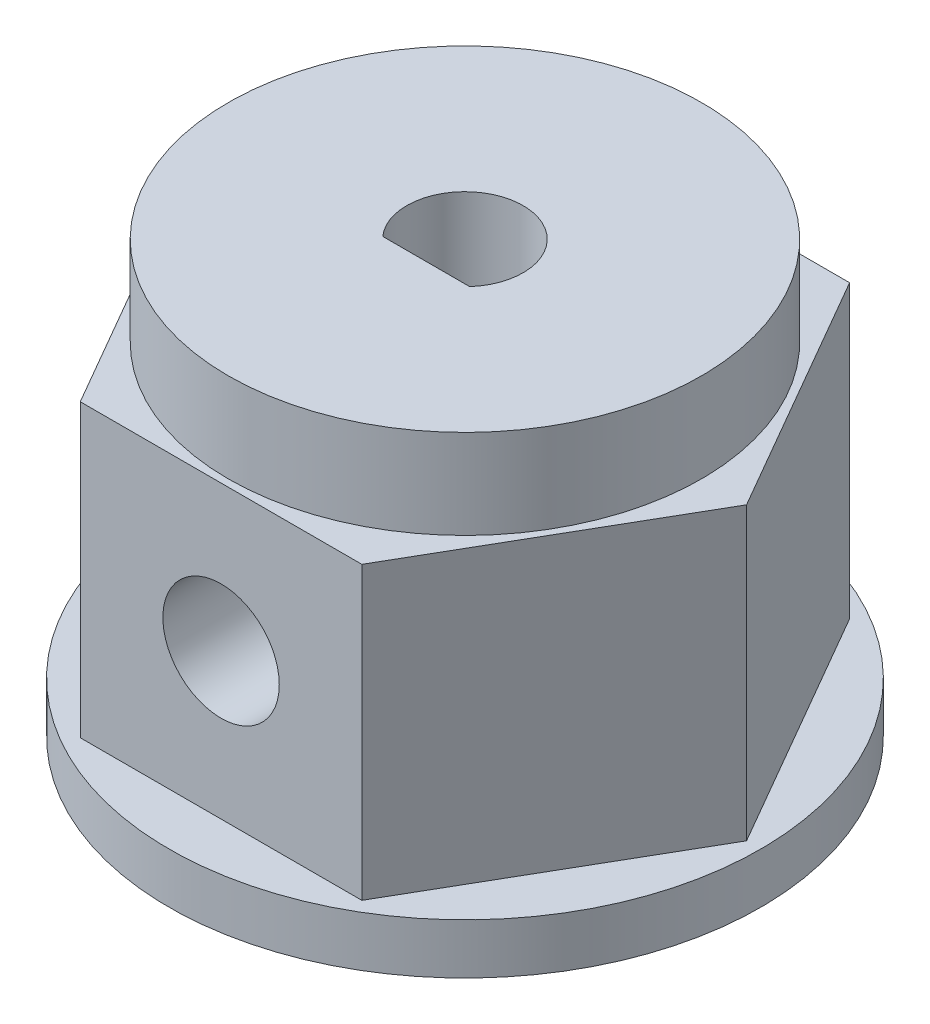
ISO-10303-21;
HEADER;
FILE_DESCRIPTION(('STEP AP214'),'2;1');
FILE_NAME('part.step','',(''),(''),'','','');
FILE_SCHEMA(('AUTOMOTIVE_DESIGN { 1 0 10303 214 1 1 1 1 }'));
ENDSEC;
DATA;
#1=APPLICATION_CONTEXT('core data for automotive mechanical design processes');
#2=APPLICATION_PROTOCOL_DEFINITION('international standard','automotive_design',2000,#1);
#3=PRODUCT_CONTEXT('',#1,'mechanical');
#4=PRODUCT('Part','Part','',(#3));
#5=PRODUCT_RELATED_PRODUCT_CATEGORY('part','',(#4));
#6=PRODUCT_DEFINITION_FORMATION('','',#4);
#7=PRODUCT_DEFINITION_CONTEXT('part definition',#1,'design');
#8=PRODUCT_DEFINITION('design','',#6,#7);
#9=PRODUCT_DEFINITION_SHAPE('','',#8);
#10=(LENGTH_UNIT() NAMED_UNIT(*) SI_UNIT(.MILLI.,.METRE.));
#11=(NAMED_UNIT(*) PLANE_ANGLE_UNIT() SI_UNIT($,.RADIAN.));
#12=(NAMED_UNIT(*) SI_UNIT($,.STERADIAN.) SOLID_ANGLE_UNIT());
#13=UNCERTAINTY_MEASURE_WITH_UNIT(LENGTH_MEASURE(1.E-05),#10,'distance_accuracy_value','');
#14=(GEOMETRIC_REPRESENTATION_CONTEXT(3) GLOBAL_UNCERTAINTY_ASSIGNED_CONTEXT((#13)) GLOBAL_UNIT_ASSIGNED_CONTEXT((#10,
#11,#12)) REPRESENTATION_CONTEXT('',''));
#15=CARTESIAN_POINT('',(0.,0.,0.));
#16=DIRECTION('',(0.,0.,1.));
#17=DIRECTION('',(1.,0.,0.));
#18=AXIS2_PLACEMENT_3D('',#15,#16,#17);
#19=CARTESIAN_POINT('',(-1.12,-1.3,0.997797574661314));
#20=DIRECTION('',(0.,0.,1.));
#21=DIRECTION('',(1.,0.,0.));
#22=AXIS2_PLACEMENT_3D('',#19,#20,#21);
#23=PLANE('',#22);
#24=DIRECTION('',(0.,1.,0.));
#25=VECTOR('',#24,1.);
#26=CARTESIAN_POINT('',(1.12,-1.3,0.997797574661314));
#27=LINE('',#26,#25);
#28=CARTESIAN_POINT('',(1.12,4.74779757466134,0.997797574661313));
#29=VERTEX_POINT('',#28);
#30=CARTESIAN_POINT('',(1.12,9.8,0.997797574661314));
#31=VERTEX_POINT('',#30);
#32=EDGE_CURVE('E138',#29,#31,#27,.T.);
#33=ORIENTED_EDGE('',*,*,#32,.F.);
#34=CARTESIAN_POINT('',(0.,3.75,0.997797574661313));
#35=DIRECTION('',(0.,0.,1.));
#36=DIRECTION('',(1.,0.,0.));
#37=AXIS2_PLACEMENT_3D('',#34,#35,#36);
#38=CIRCLE('',#37,1.5);
#39=CARTESIAN_POINT('',(-1.12,4.74779757466129,0.997797574661313));
#40=VERTEX_POINT('',#39);
#41=EDGE_CURVE('E126',#40,#29,#38,.F.);
#42=ORIENTED_EDGE('',*,*,#41,.F.);
#43=DIRECTION('',(0.,1.,0.));
#44=VECTOR('',#43,1.);
#45=CARTESIAN_POINT('',(-1.12,-1.3,0.997797574661314));
#46=LINE('',#45,#44);
#47=CARTESIAN_POINT('',(-1.12,9.8,0.997797574661314));
#48=VERTEX_POINT('',#47);
#49=EDGE_CURVE('E58',#40,#48,#46,.T.);
#50=ORIENTED_EDGE('',*,*,#49,.T.);
#51=DIRECTION('',(1.,0.,0.));
#52=VECTOR('',#51,1.);
#53=CARTESIAN_POINT('',(-1.12,9.8,0.997797574661314));
#54=LINE('',#53,#52);
#55=EDGE_CURVE('E276',#48,#31,#54,.T.);
#56=ORIENTED_EDGE('',*,*,#55,.T.);
#57=EDGE_LOOP('',(#33,#42,#50,#56));
#58=FACE_BOUND('',#57,.T.);
#59=ADVANCED_FACE('F34',(#58),#23,.F.);
#60=CARTESIAN_POINT('',(3.62864644185677,7.5,6.28499999999993));
#61=DIRECTION('',(-0.866025403784439,0.,-0.5));
#62=DIRECTION('',(-0.5,0.,0.866025403784439));
#63=AXIS2_PLACEMENT_3D('',#60,#61,#62);
#64=PLANE('',#63);
#65=DIRECTION('',(0.5,0.,-0.866025403784439));
#66=VECTOR('',#65,1.);
#67=CARTESIAN_POINT('',(3.62864644185677,0.,6.28499999999993));
#68=LINE('',#67,#66);
#69=CARTESIAN_POINT('',(3.62864644185677,0.,6.28499999999993));
#70=VERTEX_POINT('',#69);
#71=CARTESIAN_POINT('',(7.25729288371349,0.,0.));
#72=VERTEX_POINT('',#71);
#73=EDGE_CURVE('E152',#70,#72,#68,.T.);
#74=ORIENTED_EDGE('',*,*,#73,.T.);
#75=DIRECTION('',(0.,-1.,0.));
#76=VECTOR('',#75,1.);
#77=CARTESIAN_POINT('',(7.25729288371349,7.5,0.));
#78=LINE('',#77,#76);
#79=CARTESIAN_POINT('',(7.25729288371349,7.5,0.));
#80=VERTEX_POINT('',#79);
#81=EDGE_CURVE('E38',#80,#72,#78,.T.);
#82=ORIENTED_EDGE('',*,*,#81,.F.);
#83=DIRECTION('',(0.5,0.,-0.866025403784439));
#84=VECTOR('',#83,1.);
#85=CARTESIAN_POINT('',(3.62864644185677,7.5,6.28499999999993));
#86=LINE('',#85,#84);
#87=CARTESIAN_POINT('',(3.62864644185677,7.5,6.28499999999993));
#88=VERTEX_POINT('',#87);
#89=EDGE_CURVE('E154',#88,#80,#86,.T.);
#90=ORIENTED_EDGE('',*,*,#89,.F.);
#91=DIRECTION('',(0.,-1.,0.));
#92=VECTOR('',#91,1.);
#93=CARTESIAN_POINT('',(3.62864644185677,7.5,6.28499999999993));
#94=LINE('',#93,#92);
#95=EDGE_CURVE('E168',#88,#70,#94,.T.);
#96=ORIENTED_EDGE('',*,*,#95,.T.);
#97=EDGE_LOOP('',(#74,#82,#90,#96));
#98=FACE_BOUND('',#97,.T.);
#99=ADVANCED_FACE('F36',(#98),#64,.F.);
#100=CARTESIAN_POINT('',(7.25729288371349,7.5,0.));
#101=DIRECTION('',(-0.866025403784439,0.,0.5));
#102=DIRECTION('',(0.5,0.,0.866025403784439));
#103=AXIS2_PLACEMENT_3D('',#100,#101,#102);
#104=PLANE('',#103);
#105=DIRECTION('',(-0.5,0.,-0.866025403784439));
#106=VECTOR('',#105,1.);
#107=CARTESIAN_POINT('',(7.25729288371349,0.,0.));
#108=LINE('',#107,#106);
#109=CARTESIAN_POINT('',(3.62864644185665,0.,-6.28500000000001));
#110=VERTEX_POINT('',#109);
#111=EDGE_CURVE('E171',#72,#110,#108,.T.);
#112=ORIENTED_EDGE('',*,*,#111,.T.);
#113=DIRECTION('',(0.,-1.,0.));
#114=VECTOR('',#113,1.);
#115=CARTESIAN_POINT('',(3.62864644185665,7.5,-6.28500000000001));
#116=LINE('',#115,#114);
#117=CARTESIAN_POINT('',(3.62864644185665,7.5,-6.28500000000001));
#118=VERTEX_POINT('',#117);
#119=EDGE_CURVE('E195',#118,#110,#116,.T.);
#120=ORIENTED_EDGE('',*,*,#119,.F.);
#121=DIRECTION('',(-0.5,0.,-0.866025403784439));
#122=VECTOR('',#121,1.);
#123=CARTESIAN_POINT('',(7.25729288371349,7.5,0.));
#124=LINE('',#123,#122);
#125=EDGE_CURVE('E157',#80,#118,#124,.T.);
#126=ORIENTED_EDGE('',*,*,#125,.F.);
#127=ORIENTED_EDGE('',*,*,#81,.T.);
#128=EDGE_LOOP('',(#112,#120,#126,#127));
#129=FACE_BOUND('',#128,.T.);
#130=ADVANCED_FACE('F203',(#129),#104,.F.);
#131=CARTESIAN_POINT('',(3.62864644185665,7.5,-6.28500000000001));
#132=DIRECTION('',(0.,0.,1.));
#133=DIRECTION('',(1.,0.,0.));
#134=AXIS2_PLACEMENT_3D('',#131,#132,#133);
#135=PLANE('',#134);
#136=DIRECTION('',(-1.,0.,0.));
#137=VECTOR('',#136,1.);
#138=CARTESIAN_POINT('',(3.62864644185665,0.,-6.28500000000001));
#139=LINE('',#138,#137);
#140=CARTESIAN_POINT('',(-3.62864644185681,0.,-6.28500000000001));
#141=VERTEX_POINT('',#140);
#142=EDGE_CURVE('E174',#110,#141,#139,.T.);
#143=ORIENTED_EDGE('',*,*,#142,.T.);
#144=DIRECTION('',(0.,-1.,0.));
#145=VECTOR('',#144,1.);
#146=CARTESIAN_POINT('',(-3.62864644185681,7.5,-6.28500000000001));
#147=LINE('',#146,#145);
#148=CARTESIAN_POINT('',(-3.62864644185681,7.5,-6.28500000000001));
#149=VERTEX_POINT('',#148);
#150=EDGE_CURVE('E193',#149,#141,#147,.T.);
#151=ORIENTED_EDGE('',*,*,#150,.F.);
#152=DIRECTION('',(-1.,0.,0.));
#153=VECTOR('',#152,1.);
#154=CARTESIAN_POINT('',(3.62864644185665,7.5,-6.28500000000001));
#155=LINE('',#154,#153);
#156=EDGE_CURVE('E160',#118,#149,#155,.T.);
#157=ORIENTED_EDGE('',*,*,#156,.F.);
#158=ORIENTED_EDGE('',*,*,#119,.T.);
#159=EDGE_LOOP('',(#143,#151,#157,#158));
#160=FACE_BOUND('',#159,.T.);
#161=ADVANCED_FACE('F222',(#160),#135,.F.);
#162=CARTESIAN_POINT('',(-3.62864644185681,7.5,-6.28500000000001));
#163=DIRECTION('',(0.866025403784438,0.,0.500000000000001));
#164=DIRECTION('',(0.500000000000001,0.,-0.866025403784438));
#165=AXIS2_PLACEMENT_3D('',#162,#163,#164);
#166=PLANE('',#165);
#167=DIRECTION('',(-0.500000000000001,0.,0.866025403784438));
#168=VECTOR('',#167,1.);
#169=CARTESIAN_POINT('',(-3.62864644185681,0.,-6.28500000000001));
#170=LINE('',#169,#168);
#171=CARTESIAN_POINT('',(-7.25729288371363,0.,0.));
#172=VERTEX_POINT('',#171);
#173=EDGE_CURVE('E177',#141,#172,#170,.T.);
#174=ORIENTED_EDGE('',*,*,#173,.T.);
#175=DIRECTION('',(0.,-1.,0.));
#176=VECTOR('',#175,1.);
#177=CARTESIAN_POINT('',(-7.25729288371363,7.5,0.));
#178=LINE('',#177,#176);
#179=CARTESIAN_POINT('',(-7.25729288371363,7.5,0.));
#180=VERTEX_POINT('',#179);
#181=EDGE_CURVE('E190',#180,#172,#178,.T.);
#182=ORIENTED_EDGE('',*,*,#181,.F.);
#183=DIRECTION('',(-0.500000000000001,0.,0.866025403784438));
#184=VECTOR('',#183,1.);
#185=CARTESIAN_POINT('',(-3.62864644185681,7.5,-6.28500000000001));
#186=LINE('',#185,#184);
#187=EDGE_CURVE('E162',#149,#180,#186,.T.);
#188=ORIENTED_EDGE('',*,*,#187,.F.);
#189=ORIENTED_EDGE('',*,*,#150,.T.);
#190=EDGE_LOOP('',(#174,#182,#188,#189));
#191=FACE_BOUND('',#190,.T.);
#192=ADVANCED_FACE('F219',(#191),#166,.F.);
#193=CARTESIAN_POINT('',(-7.25729288371363,7.5,0.));
#194=DIRECTION('',(0.866025403784439,0.,-0.499999999999999));
#195=DIRECTION('',(-0.499999999999999,0.,-0.866025403784439));
#196=AXIS2_PLACEMENT_3D('',#193,#194,#195);
#197=PLANE('',#196);
#198=DIRECTION('',(0.499999999999999,0.,0.866025403784439));
#199=VECTOR('',#198,1.);
#200=CARTESIAN_POINT('',(-7.25729288371363,0.,0.));
#201=LINE('',#200,#199);
#202=CARTESIAN_POINT('',(-3.62864644185686,0.,6.28499999999996));
#203=VERTEX_POINT('',#202);
#204=EDGE_CURVE('E180',#172,#203,#201,.T.);
#205=ORIENTED_EDGE('',*,*,#204,.T.);
#206=DIRECTION('',(0.,-1.,0.));
#207=VECTOR('',#206,1.);
#208=CARTESIAN_POINT('',(-3.62864644185686,7.5,6.28499999999996));
#209=LINE('',#208,#207);
#210=CARTESIAN_POINT('',(-3.62864644185686,7.5,6.28499999999996));
#211=VERTEX_POINT('',#210);
#212=EDGE_CURVE('E187',#211,#203,#209,.T.);
#213=ORIENTED_EDGE('',*,*,#212,.F.);
#214=DIRECTION('',(0.499999999999999,0.,0.866025403784439));
#215=VECTOR('',#214,1.);
#216=CARTESIAN_POINT('',(-7.25729288371363,7.5,0.));
#217=LINE('',#216,#215);
#218=EDGE_CURVE('E164',#180,#211,#217,.T.);
#219=ORIENTED_EDGE('',*,*,#218,.F.);
#220=ORIENTED_EDGE('',*,*,#181,.T.);
#221=EDGE_LOOP('',(#205,#213,#219,#220));
#222=FACE_BOUND('',#221,.T.);
#223=ADVANCED_FACE('F216',(#222),#197,.F.);
#224=CARTESIAN_POINT('',(-3.62864644185686,7.5,6.28499999999996));
#225=DIRECTION('',(0.,0.,-1.));
#226=DIRECTION('',(-1.,0.,0.));
#227=AXIS2_PLACEMENT_3D('',#224,#225,#226);
#228=PLANE('',#227);
#229=CARTESIAN_POINT('',(0.,3.75,6.28499999999994));
#230=DIRECTION('',(0.,0.,1.));
#231=DIRECTION('',(1.,0.,0.));
#232=AXIS2_PLACEMENT_3D('',#229,#230,#231);
#233=CIRCLE('',#232,1.5);
#234=CARTESIAN_POINT('',(1.50000000000002,3.75,6.28499999999994));
#235=VERTEX_POINT('',#234);
#236=EDGE_CURVE('E277',#235,#235,#233,.T.);
#237=ORIENTED_EDGE('',*,*,#236,.F.);
#238=EDGE_LOOP('',(#237));
#239=FACE_BOUND('',#238,.T.);
#240=DIRECTION('',(1.,0.,0.));
#241=VECTOR('',#240,1.);
#242=CARTESIAN_POINT('',(-3.62864644185686,0.,6.28499999999996));
#243=LINE('',#242,#241);
#244=EDGE_CURVE('E158',#203,#70,#243,.T.);
#245=ORIENTED_EDGE('',*,*,#244,.T.);
#246=ORIENTED_EDGE('',*,*,#95,.F.);
#247=DIRECTION('',(1.,0.,0.));
#248=VECTOR('',#247,1.);
#249=CARTESIAN_POINT('',(-3.62864644185686,7.5,6.28499999999996));
#250=LINE('',#249,#248);
#251=EDGE_CURVE('E166',#211,#88,#250,.T.);
#252=ORIENTED_EDGE('',*,*,#251,.F.);
#253=ORIENTED_EDGE('',*,*,#212,.T.);
#254=EDGE_LOOP('',(#245,#246,#252,#253));
#255=FACE_BOUND('',#254,.T.);
#256=ADVANCED_FACE('F211',(#239,#255),#228,.F.);
#257=CARTESIAN_POINT('',(0.,7.5,0.));
#258=DIRECTION('',(0.,1.,0.));
#259=DIRECTION('',(0.,0.,1.));
#260=AXIS2_PLACEMENT_3D('',#257,#258,#259);
#261=PLANE('',#260);
#262=CARTESIAN_POINT('',(0.,7.5,0.));
#263=DIRECTION('',(0.,1.,0.));
#264=DIRECTION('',(0.,0.,1.));
#265=AXIS2_PLACEMENT_3D('',#262,#263,#264);
#266=CIRCLE('',#265,6.1);
#267=CARTESIAN_POINT('',(0.,7.5,6.1));
#268=VERTEX_POINT('',#267);
#269=EDGE_CURVE('E11',#268,#268,#266,.T.);
#270=ORIENTED_EDGE('',*,*,#269,.F.);
#271=EDGE_LOOP('',(#270));
#272=FACE_BOUND('',#271,.T.);
#273=ORIENTED_EDGE('',*,*,#89,.T.);
#274=ORIENTED_EDGE('',*,*,#125,.T.);
#275=ORIENTED_EDGE('',*,*,#156,.T.);
#276=ORIENTED_EDGE('',*,*,#187,.T.);
#277=ORIENTED_EDGE('',*,*,#218,.T.);
#278=ORIENTED_EDGE('',*,*,#251,.T.);
#279=EDGE_LOOP('',(#273,#274,#275,#276,#277,#278));
#280=FACE_BOUND('',#279,.T.);
#281=ADVANCED_FACE('F224',(#272,#280),#261,.T.);
#282=CARTESIAN_POINT('',(0.,9.8,0.));
#283=DIRECTION('',(0.,-1.,0.));
#284=DIRECTION('',(0.,0.,-1.));
#285=AXIS2_PLACEMENT_3D('',#282,#283,#284);
#286=CYLINDRICAL_SURFACE('',#285,6.1);
#287=CARTESIAN_POINT('',(0.,9.8,0.));
#288=DIRECTION('',(0.,1.,0.));
#289=DIRECTION('',(0.,0.,1.));
#290=AXIS2_PLACEMENT_3D('',#287,#288,#289);
#291=CIRCLE('',#290,6.1);
#292=CARTESIAN_POINT('',(0.,9.8,6.1));
#293=VERTEX_POINT('',#292);
#294=EDGE_CURVE('E147',#293,#293,#291,.T.);
#295=ORIENTED_EDGE('',*,*,#294,.F.);
#296=EDGE_LOOP('',(#295));
#297=FACE_BOUND('',#296,.T.);
#298=ORIENTED_EDGE('',*,*,#269,.T.);
#299=EDGE_LOOP('',(#298));
#300=FACE_BOUND('',#299,.T.);
#301=ADVANCED_FACE('F226',(#297,#300),#286,.T.);
#302=CARTESIAN_POINT('',(0.,9.8,0.));
#303=DIRECTION('',(0.,1.,0.));
#304=DIRECTION('',(0.,0.,1.));
#305=AXIS2_PLACEMENT_3D('',#302,#303,#304);
#306=PLANE('',#305);
#307=CARTESIAN_POINT('',(0.,9.8,0.));
#308=DIRECTION('',(0.,1.,0.));
#309=DIRECTION('',(0.,0.,1.));
#310=AXIS2_PLACEMENT_3D('',#307,#308,#309);
#311=CIRCLE('',#310,1.5);
#312=EDGE_CURVE('E273',#31,#48,#311,.T.);
#313=ORIENTED_EDGE('',*,*,#312,.F.);
#314=ORIENTED_EDGE('',*,*,#55,.F.);
#315=EDGE_LOOP('',(#313,#314));
#316=FACE_BOUND('',#315,.T.);
#317=ORIENTED_EDGE('',*,*,#294,.T.);
#318=EDGE_LOOP('',(#317));
#319=FACE_BOUND('',#318,.T.);
#320=ADVANCED_FACE('F233',(#316,#319),#306,.T.);
#321=CARTESIAN_POINT('',(0.,-1.3,0.));
#322=DIRECTION('',(0.,1.,0.));
#323=DIRECTION('',(0.,0.,1.));
#324=AXIS2_PLACEMENT_3D('',#321,#322,#323);
#325=CYLINDRICAL_SURFACE('',#324,7.625);
#326=CARTESIAN_POINT('',(0.,-1.3,0.));
#327=DIRECTION('',(0.,-1.,0.));
#328=DIRECTION('',(0.,0.,-1.));
#329=AXIS2_PLACEMENT_3D('',#326,#327,#328);
#330=CIRCLE('',#329,7.625);
#331=CARTESIAN_POINT('',(0.,-1.3,-7.625));
#332=VERTEX_POINT('',#331);
#333=EDGE_CURVE('E144',#332,#332,#330,.T.);
#334=ORIENTED_EDGE('',*,*,#333,.F.);
#335=EDGE_LOOP('',(#334));
#336=FACE_BOUND('',#335,.T.);
#337=CARTESIAN_POINT('',(0.,0.,0.));
#338=DIRECTION('',(0.,-1.,0.));
#339=DIRECTION('',(0.,0.,-1.));
#340=AXIS2_PLACEMENT_3D('',#337,#338,#339);
#341=CIRCLE('',#340,7.625);
#342=CARTESIAN_POINT('',(0.,0.,-7.625));
#343=VERTEX_POINT('',#342);
#344=EDGE_CURVE('E148',#343,#343,#341,.T.);
#345=ORIENTED_EDGE('',*,*,#344,.T.);
#346=EDGE_LOOP('',(#345));
#347=FACE_BOUND('',#346,.T.);
#348=ADVANCED_FACE('F260',(#336,#347),#325,.T.);
#349=CARTESIAN_POINT('',(0.,-1.3,0.));
#350=DIRECTION('',(0.,-1.,0.));
#351=DIRECTION('',(0.,0.,-1.));
#352=AXIS2_PLACEMENT_3D('',#349,#350,#351);
#353=PLANE('',#352);
#354=CARTESIAN_POINT('',(0.,-1.3,0.));
#355=DIRECTION('',(0.,1.,0.));
#356=DIRECTION('',(0.,0.,1.));
#357=AXIS2_PLACEMENT_3D('',#354,#355,#356);
#358=CIRCLE('',#357,1.5);
#359=CARTESIAN_POINT('',(1.12,-1.3,0.997797574661314));
#360=VERTEX_POINT('',#359);
#361=CARTESIAN_POINT('',(-1.12,-1.3,0.997797574661314));
#362=VERTEX_POINT('',#361);
#363=EDGE_CURVE('E279',#360,#362,#358,.T.);
#364=ORIENTED_EDGE('',*,*,#363,.T.);
#365=DIRECTION('',(1.,0.,0.));
#366=VECTOR('',#365,1.);
#367=CARTESIAN_POINT('',(-1.12,-1.3,0.997797574661314));
#368=LINE('',#367,#366);
#369=EDGE_CURVE('E136',#362,#360,#368,.T.);
#370=ORIENTED_EDGE('',*,*,#369,.T.);
#371=EDGE_LOOP('',(#364,#370));
#372=FACE_BOUND('',#371,.T.);
#373=ORIENTED_EDGE('',*,*,#333,.T.);
#374=EDGE_LOOP('',(#373));
#375=FACE_BOUND('',#374,.T.);
#376=ADVANCED_FACE('F256',(#372,#375),#353,.T.);
#377=CARTESIAN_POINT('',(0.,0.,0.));
#378=DIRECTION('',(0.,-1.,0.));
#379=DIRECTION('',(0.,0.,-1.));
#380=AXIS2_PLACEMENT_3D('',#377,#378,#379);
#381=PLANE('',#380);
#382=ORIENTED_EDGE('',*,*,#73,.F.);
#383=ORIENTED_EDGE('',*,*,#244,.F.);
#384=ORIENTED_EDGE('',*,*,#204,.F.);
#385=ORIENTED_EDGE('',*,*,#173,.F.);
#386=ORIENTED_EDGE('',*,*,#142,.F.);
#387=ORIENTED_EDGE('',*,*,#111,.F.);
#388=EDGE_LOOP('',(#382,#383,#384,#385,#386,#387));
#389=FACE_BOUND('',#388,.T.);
#390=ORIENTED_EDGE('',*,*,#344,.F.);
#391=EDGE_LOOP('',(#390));
#392=FACE_BOUND('',#391,.T.);
#393=ADVANCED_FACE('F208',(#389,#392),#381,.F.);
#394=CARTESIAN_POINT('',(0.,-1.3,0.));
#395=DIRECTION('',(0.,1.,0.));
#396=DIRECTION('',(0.,0.,1.));
#397=AXIS2_PLACEMENT_3D('',#394,#395,#396);
#398=CYLINDRICAL_SURFACE('',#397,1.5);
#399=CARTESIAN_POINT('',(1.12,2.75220242533866,0.997797574661313));
#400=VERTEX_POINT('',#399);
#401=EDGE_CURVE('E140',#360,#400,#27,.T.);
#402=ORIENTED_EDGE('',*,*,#401,.T.);
#403=CARTESIAN_POINT('',(0.,3.75,0.));
#404=DIRECTION('',(0.,0.707106781186547,0.707106781186547));
#405=DIRECTION('',(0.,-0.707106781186547,0.707106781186547));
#406=AXIS2_PLACEMENT_3D('',#403,#404,#405);
#407=ELLIPSE('',#406,2.12132034355964,1.5);
#408=CARTESIAN_POINT('',(1.50000000000001,3.75,0.));
#409=VERTEX_POINT('',#408);
#410=EDGE_CURVE('E50',#409,#400,#407,.F.);
#411=ORIENTED_EDGE('',*,*,#410,.F.);
#412=CARTESIAN_POINT('',(0.,3.75,0.));
#413=DIRECTION('',(0.,-0.707106781186547,0.707106781186547));
#414=DIRECTION('',(0.,0.707106781186547,0.707106781186547));
#415=AXIS2_PLACEMENT_3D('',#412,#413,#414);
#416=ELLIPSE('',#415,2.12132034355964,1.5);
#417=EDGE_CURVE('E285',#29,#409,#416,.F.);
#418=ORIENTED_EDGE('',*,*,#417,.F.);
#419=ORIENTED_EDGE('',*,*,#32,.T.);
#420=ORIENTED_EDGE('',*,*,#312,.T.);
#421=ORIENTED_EDGE('',*,*,#49,.F.);
#422=CARTESIAN_POINT('',(-1.49999999999999,3.75,0.));
#423=VERTEX_POINT('',#422);
#424=EDGE_CURVE('E132',#423,#40,#416,.F.);
#425=ORIENTED_EDGE('',*,*,#424,.F.);
#426=CARTESIAN_POINT('',(-1.12,2.75220242533869,0.997797574661314));
#427=VERTEX_POINT('',#426);
#428=EDGE_CURVE('E120',#427,#423,#407,.F.);
#429=ORIENTED_EDGE('',*,*,#428,.F.);
#430=EDGE_CURVE('E130',#362,#427,#46,.T.);
#431=ORIENTED_EDGE('',*,*,#430,.F.);
#432=ORIENTED_EDGE('',*,*,#363,.F.);
#433=EDGE_LOOP('',(#402,#411,#418,#419,#420,#421,#425,#429,#431,#432));
#434=FACE_BOUND('',#433,.T.);
#435=ADVANCED_FACE('F129',(#434),#398,.F.);
#436=ORIENTED_EDGE('',*,*,#430,.T.);
#437=EDGE_CURVE('E117',#400,#427,#38,.F.);
#438=ORIENTED_EDGE('',*,*,#437,.F.);
#439=ORIENTED_EDGE('',*,*,#401,.F.);
#440=ORIENTED_EDGE('',*,*,#369,.F.);
#441=EDGE_LOOP('',(#436,#438,#439,#440));
#442=FACE_BOUND('',#441,.T.);
#443=ADVANCED_FACE('F134',(#442),#23,.F.);
#444=CARTESIAN_POINT('',(0.,3.75,-7.626));
#445=DIRECTION('',(0.,0.,1.));
#446=DIRECTION('',(1.,0.,0.));
#447=AXIS2_PLACEMENT_3D('',#444,#445,#446);
#448=CYLINDRICAL_SURFACE('',#447,1.5);
#449=ORIENTED_EDGE('',*,*,#236,.T.);
#450=EDGE_LOOP('',(#449));
#451=FACE_BOUND('',#450,.T.);
#452=ORIENTED_EDGE('',*,*,#437,.T.);
#453=ORIENTED_EDGE('',*,*,#428,.T.);
#454=ORIENTED_EDGE('',*,*,#424,.T.);
#455=ORIENTED_EDGE('',*,*,#41,.T.);
#456=ORIENTED_EDGE('',*,*,#417,.T.);
#457=ORIENTED_EDGE('',*,*,#410,.T.);
#458=EDGE_LOOP('',(#452,#453,#454,#455,#456,#457));
#459=FACE_BOUND('',#458,.T.);
#460=ADVANCED_FACE('F119',(#451,#459),#448,.F.);
#461=CLOSED_SHELL('',(#59,#99,#130,#161,#192,#223,#256,#281,#301,#320,#348,#376,#393,#435,#443,#460));
#462=MANIFOLD_SOLID_BREP('B2',#461);
#463=ADVANCED_BREP_SHAPE_REPRESENTATION('',(#18,#462),#14);
#464=SHAPE_DEFINITION_REPRESENTATION(#9,#463);
ENDSEC;
END-ISO-10303-21;
